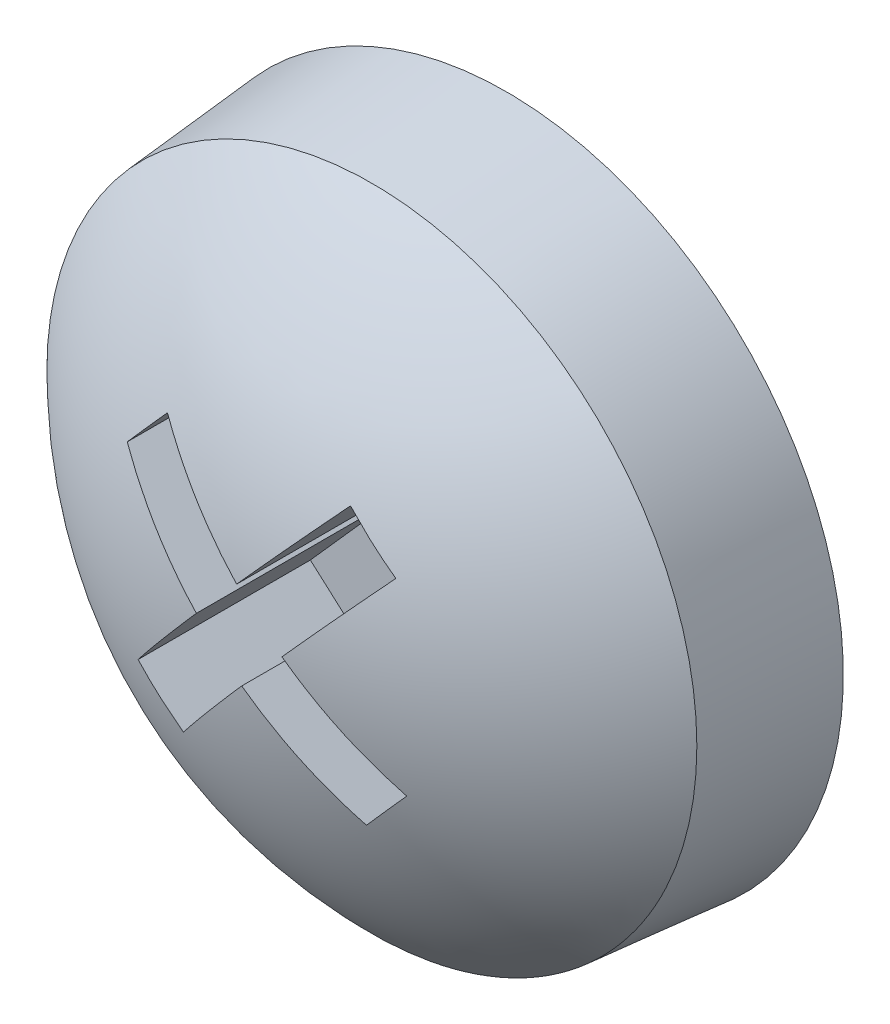
ISO-10303-21;
HEADER;
FILE_DESCRIPTION(('STEP AP214'),'2;1');
FILE_NAME('part.step','',(''),(''),'','','');
FILE_SCHEMA(('AUTOMOTIVE_DESIGN { 1 0 10303 214 1 1 1 1 }'));
ENDSEC;
DATA;
#1=APPLICATION_CONTEXT('core data for automotive mechanical design processes');
#2=APPLICATION_PROTOCOL_DEFINITION('international standard','automotive_design',2000,#1);
#3=PRODUCT_CONTEXT('',#1,'mechanical');
#4=PRODUCT('Part','Part','',(#3));
#5=PRODUCT_RELATED_PRODUCT_CATEGORY('part','',(#4));
#6=PRODUCT_DEFINITION_FORMATION('','',#4);
#7=PRODUCT_DEFINITION_CONTEXT('part definition',#1,'design');
#8=PRODUCT_DEFINITION('design','',#6,#7);
#9=PRODUCT_DEFINITION_SHAPE('','',#8);
#10=(LENGTH_UNIT() NAMED_UNIT(*) SI_UNIT(.MILLI.,.METRE.));
#11=(NAMED_UNIT(*) PLANE_ANGLE_UNIT() SI_UNIT($,.RADIAN.));
#12=(NAMED_UNIT(*) SI_UNIT($,.STERADIAN.) SOLID_ANGLE_UNIT());
#13=UNCERTAINTY_MEASURE_WITH_UNIT(LENGTH_MEASURE(1.E-05),#10,'distance_accuracy_value','');
#14=(GEOMETRIC_REPRESENTATION_CONTEXT(3) GLOBAL_UNCERTAINTY_ASSIGNED_CONTEXT((#13)) GLOBAL_UNIT_ASSIGNED_CONTEXT((#10,
#11,#12)) REPRESENTATION_CONTEXT('',''));
#15=CARTESIAN_POINT('',(0.,0.,0.));
#16=DIRECTION('',(0.,0.,1.));
#17=DIRECTION('',(1.,0.,0.));
#18=AXIS2_PLACEMENT_3D('',#15,#16,#17);
#19=CARTESIAN_POINT('',(6.89997712496555,4.50501230247056,21.6));
#20=DIRECTION('',(0.,0.,1.));
#21=DIRECTION('',(0.,-1.,0.));
#22=AXIS2_PLACEMENT_3D('',#19,#20,#21);
#23=PLANE('',#22);
#24=DIRECTION('',(0.747876143588401,-0.66383828893138,0.));
#25=VECTOR('',#24,1.);
#26=CARTESIAN_POINT('',(7.0194680169732,4.63963000831647,21.6));
#27=LINE('',#26,#25);
#28=CARTESIAN_POINT('',(7.15408572281911,4.52013911630882,21.6));
#29=VERTEX_POINT('',#28);
#30=CARTESIAN_POINT('',(7.72995035338218,4.00898363383166,21.6));
#31=VERTEX_POINT('',#30);
#32=EDGE_CURVE('E84',#29,#31,#27,.T.);
#33=ORIENTED_EDGE('',*,*,#32,.F.);
#34=DIRECTION('',(-0.66383828893138,-0.747876143588401,0.));
#35=VECTOR('',#34,1.);
#36=CARTESIAN_POINT('',(7.03459483081146,4.38552141046291,21.6));
#37=LINE('',#36,#35);
#38=CARTESIAN_POINT('',(7.66524120529627,5.09600374687189,21.6));
#39=VERTEX_POINT('',#38);
#40=EDGE_CURVE('E89',#39,#29,#37,.T.);
#41=ORIENTED_EDGE('',*,*,#40,.F.);
#42=DIRECTION('',(0.747876143588401,-0.66383828893138,0.));
#43=VECTOR('',#42,1.);
#44=CARTESIAN_POINT('',(7.53062349945036,5.21549463887954,21.6));
#45=LINE('',#44,#43);
#46=CARTESIAN_POINT('',(7.39600579360445,5.33498553088719,21.6));
#47=VERTEX_POINT('',#46);
#48=EDGE_CURVE('E140',#47,#39,#45,.T.);
#49=ORIENTED_EDGE('',*,*,#48,.F.);
#50=DIRECTION('',(0.66383828893138,0.747876143588401,0.));
#51=VECTOR('',#50,1.);
#52=CARTESIAN_POINT('',(6.76535941911964,4.62450319447821,21.6));
#53=LINE('',#52,#51);
#54=CARTESIAN_POINT('',(6.88485031112729,4.75912090032412,21.6));
#55=VERTEX_POINT('',#54);
#56=EDGE_CURVE('E151',#55,#47,#53,.T.);
#57=ORIENTED_EDGE('',*,*,#56,.F.);
#58=DIRECTION('',(0.747876143588401,-0.66383828893138,0.));
#59=VECTOR('',#58,1.);
#60=CARTESIAN_POINT('',(7.0194680169732,4.63963000831647,21.6));
#61=LINE('',#60,#59);
#62=CARTESIAN_POINT('',(6.30898568056422,5.27027638280128,21.6));
#63=VERTEX_POINT('',#62);
#64=EDGE_CURVE('E154',#63,#55,#61,.T.);
#65=ORIENTED_EDGE('',*,*,#64,.F.);
#66=DIRECTION('',(0.66383828893138,0.747876143588401,0.));
#67=VECTOR('',#66,1.);
#68=CARTESIAN_POINT('',(6.18949478855657,5.13565867695537,21.6));
#69=LINE('',#68,#67);
#70=CARTESIAN_POINT('',(6.07000389654892,5.00104097110946,21.6));
#71=VERTEX_POINT('',#70);
#72=EDGE_CURVE('E162',#71,#63,#69,.T.);
#73=ORIENTED_EDGE('',*,*,#72,.F.);
#74=DIRECTION('',(-0.747876143588401,0.66383828893138,0.));
#75=VECTOR('',#74,1.);
#76=CARTESIAN_POINT('',(6.7804862329579,4.37039459662465,21.6));
#77=LINE('',#76,#75);
#78=CARTESIAN_POINT('',(6.64586852711199,4.4898854886323,21.6));
#79=VERTEX_POINT('',#78);
#80=EDGE_CURVE('E167',#79,#71,#77,.T.);
#81=ORIENTED_EDGE('',*,*,#80,.F.);
#82=DIRECTION('',(0.66383828893138,0.747876143588401,0.));
#83=VECTOR('',#82,1.);
#84=CARTESIAN_POINT('',(6.76535941911964,4.62450319447821,21.6));
#85=LINE('',#84,#83);
#86=CARTESIAN_POINT('',(6.13471304463483,3.91402085806923,21.6));
#87=VERTEX_POINT('',#86);
#88=EDGE_CURVE('E172',#87,#79,#85,.T.);
#89=ORIENTED_EDGE('',*,*,#88,.F.);
#90=DIRECTION('',(0.747876143588401,-0.66383828893138,0.));
#91=VECTOR('',#90,1.);
#92=CARTESIAN_POINT('',(6.26933075048074,3.79452996606158,21.6));
#93=LINE('',#92,#91);
#94=CARTESIAN_POINT('',(6.40394845632666,3.67503907405393,21.6));
#95=VERTEX_POINT('',#94);
#96=EDGE_CURVE('E178',#87,#95,#93,.T.);
#97=ORIENTED_EDGE('',*,*,#96,.T.);
#98=DIRECTION('',(-0.66383828893138,-0.747876143588401,0.));
#99=VECTOR('',#98,1.);
#100=CARTESIAN_POINT('',(7.03459483081146,4.38552141046291,21.6));
#101=LINE('',#100,#99);
#102=CARTESIAN_POINT('',(6.91510393880381,4.250903704617,21.6));
#103=VERTEX_POINT('',#102);
#104=EDGE_CURVE('E183',#103,#95,#101,.T.);
#105=ORIENTED_EDGE('',*,*,#104,.F.);
#106=DIRECTION('',(-0.747876143588401,0.66383828893138,0.));
#107=VECTOR('',#106,1.);
#108=CARTESIAN_POINT('',(6.7804862329579,4.37039459662465,21.6));
#109=LINE('',#108,#107);
#110=CARTESIAN_POINT('',(7.49096856936688,3.73974822213984,21.6));
#111=VERTEX_POINT('',#110);
#112=EDGE_CURVE('E119',#111,#103,#109,.T.);
#113=ORIENTED_EDGE('',*,*,#112,.F.);
#114=DIRECTION('',(0.66383828893138,0.747876143588401,0.));
#115=VECTOR('',#114,1.);
#116=CARTESIAN_POINT('',(7.61045946137453,3.87436592798575,21.6));
#117=LINE('',#116,#115);
#118=EDGE_CURVE('E117',#111,#31,#117,.T.);
#119=ORIENTED_EDGE('',*,*,#118,.T.);
#120=EDGE_LOOP('',(#33,#41,#49,#57,#65,#73,#81,#89,#97,#105,#113,#119));
#121=FACE_BOUND('',#120,.T.);
#122=ADVANCED_FACE('F17',(#121),#23,.T.);
#123=CARTESIAN_POINT('',(7.0194680169732,4.63963000831647,22.2));
#124=DIRECTION('',(-0.66383828893138,-0.747876143588401,0.));
#125=DIRECTION('',(0.747876143588401,-0.66383828893138,0.));
#126=AXIS2_PLACEMENT_3D('',#123,#124,#125);
#127=PLANE('',#126);
#128=DIRECTION('',(0.,0.,1.));
#129=VECTOR('',#128,1.);
#130=CARTESIAN_POINT('',(7.15408572281911,4.52013911630882,22.2));
#131=LINE('',#130,#129);
#132=CARTESIAN_POINT('',(7.15408572281911,4.52013911630882,22.788097569794));
#133=VERTEX_POINT('',#132);
#134=EDGE_CURVE('E127',#29,#133,#131,.T.);
#135=ORIENTED_EDGE('',*,*,#134,.F.);
#136=ORIENTED_EDGE('',*,*,#32,.T.);
#137=DIRECTION('',(0.,0.,1.));
#138=VECTOR('',#137,1.);
#139=CARTESIAN_POINT('',(7.72995035338218,4.00898363383166,22.2));
#140=LINE('',#139,#138);
#141=CARTESIAN_POINT('',(7.72995035338218,4.00898363383166,22.6229045231911));
#142=VERTEX_POINT('',#141);
#143=EDGE_CURVE('E123',#31,#142,#140,.T.);
#144=ORIENTED_EDGE('',*,*,#143,.T.);
#145=CARTESIAN_POINT('',(7.15408572281911,4.52013911630882,22.788097569794));
#146=CARTESIAN_POINT('',(7.17877165659901,4.49822710830909,22.7859104299673));
#147=CARTESIAN_POINT('',(7.20342772135599,4.4763416129896,22.7831210421487));
#148=CARTESIAN_POINT('',(7.25255070327682,4.43273851567851,22.7763560552392));
#149=CARTESIAN_POINT('',(7.27701798297534,4.41102059188976,22.7723851623111));
#150=CARTESIAN_POINT('',(7.32576464164366,4.36775153088425,22.7632701136372));
#151=CARTESIAN_POINT('',(7.35004434494988,4.3462001057763,22.7581290588921));
#152=CARTESIAN_POINT('',(7.39841672115628,4.30326326960671,22.7466823115268));
#153=CARTESIAN_POINT('',(7.42250959829504,4.2818776772565,22.7403781619621));
#154=CARTESIAN_POINT('',(7.47050909335735,4.23927182206924,22.7266089835755));
#155=CARTESIAN_POINT('',(7.49441571128089,4.2180515592322,22.7191439547536));
#156=CARTESIAN_POINT('',(7.5420428123996,4.17577625257286,22.703052205587));
#157=CARTESIAN_POINT('',(7.56576300849104,4.15472146359282,22.6944239659575));
#158=CARTESIAN_POINT('',(7.61301615058749,4.11277809467423,22.6760004253173));
#159=CARTESIAN_POINT('',(7.63654844108106,4.09189009658817,22.666202118307));
#160=CARTESIAN_POINT('',(7.68342385204351,4.05028201365486,22.6454289197685));
#161=CARTESIAN_POINT('',(7.70676585941599,4.02956291682684,22.6344495373844));
#162=CARTESIAN_POINT('',(7.72995035338216,4.00898363383167,22.622904523191));
#163=B_SPLINE_CURVE_WITH_KNOTS('',3,(#145,#146,#147,#148,#149,#150,#151,#152,#153,#154,#155,
#156,#157,#158,#159,#160,#161,#162),.UNSPECIFIED.,.F.,.F.,(4,2,2,2,2,2,2,2,4),(0.,
0.0992357442434155,0.198081387639264,0.29666807248049,0.395124892694088,0.493581712907686,
0.59216839774891,0.691014041144759,0.790249785388175),.UNSPECIFIED.);
#164=EDGE_CURVE('E20',#133,#142,#163,.T.);
#165=ORIENTED_EDGE('',*,*,#164,.F.);
#166=EDGE_LOOP('',(#135,#136,#144,#165));
#167=FACE_BOUND('',#166,.T.);
#168=ADVANCED_FACE('F125',(#167),#127,.T.);
#169=CARTESIAN_POINT('',(7.61045946137453,3.87436592798575,22.2));
#170=DIRECTION('',(0.747876143588401,-0.66383828893138,0.));
#171=DIRECTION('',(0.66383828893138,0.747876143588401,0.));
#172=AXIS2_PLACEMENT_3D('',#169,#170,#171);
#173=PLANE('',#172);
#174=ORIENTED_EDGE('',*,*,#118,.F.);
#175=DIRECTION('',(0.,0.,1.));
#176=VECTOR('',#175,1.);
#177=CARTESIAN_POINT('',(7.49096856936688,3.73974822213984,22.2));
#178=LINE('',#177,#176);
#179=CARTESIAN_POINT('',(7.49096856936687,3.73974822213984,22.6229045231911));
#180=VERTEX_POINT('',#179);
#181=EDGE_CURVE('E132',#180,#111,#178,.F.);
#182=ORIENTED_EDGE('',*,*,#181,.F.);
#183=CARTESIAN_POINT('',(7.72995035338217,4.00898363383166,22.622904523191));
#184=CARTESIAN_POINT('',(7.69012005604629,3.96411106521635,22.6271329188894));
#185=CARTESIAN_POINT('',(7.65028975871041,3.91923849660105,22.6292471167385));
#186=CARTESIAN_POINT('',(7.57062916403865,3.82949335937045,22.6292471167385));
#187=CARTESIAN_POINT('',(7.53079886670277,3.78462079075514,22.6271329188894));
#188=CARTESIAN_POINT('',(7.49096856936688,3.73974822213984,22.622904523191));
#189=B_SPLINE_CURVE_WITH_KNOTS('',3,(#183,#184,#185,#186,#187,#188),.UNSPECIFIED.,.F.,.F.,(4,2,
4),(0.,0.180111711148684,0.360223422297368),.UNSPECIFIED.);
#190=EDGE_CURVE('E131',#142,#180,#189,.T.);
#191=ORIENTED_EDGE('',*,*,#190,.F.);
#192=ORIENTED_EDGE('',*,*,#143,.F.);
#193=EDGE_LOOP('',(#174,#182,#191,#192));
#194=FACE_BOUND('',#193,.T.);
#195=ADVANCED_FACE('F129',(#194),#173,.F.);
#196=CARTESIAN_POINT('',(6.7804862329579,4.37039459662465,22.2));
#197=DIRECTION('',(0.66383828893138,0.747876143588401,0.));
#198=DIRECTION('',(-0.747876143588401,0.66383828893138,0.));
#199=AXIS2_PLACEMENT_3D('',#196,#197,#198);
#200=PLANE('',#199);
#201=DIRECTION('',(0.,0.,1.));
#202=VECTOR('',#201,1.);
#203=CARTESIAN_POINT('',(6.91510393880381,4.250903704617,22.2));
#204=LINE('',#203,#202);
#205=CARTESIAN_POINT('',(6.91510393880381,4.250903704617,22.788097569794));
#206=VERTEX_POINT('',#205);
#207=EDGE_CURVE('E180',#206,#103,#204,.F.);
#208=ORIENTED_EDGE('',*,*,#207,.F.);
#209=CARTESIAN_POINT('',(7.49096856936687,3.73974822213985,22.622904523191));
#210=CARTESIAN_POINT('',(7.46778407540069,3.76032750513502,22.6344495373844));
#211=CARTESIAN_POINT('',(7.44444206802821,3.78104660196304,22.6454289197685));
#212=CARTESIAN_POINT('',(7.39756665706576,3.82265468489635,22.666202118307));
#213=CARTESIAN_POINT('',(7.37403436657219,3.84354268298241,22.6760004253173));
#214=CARTESIAN_POINT('',(7.32678122447574,3.885486051901,22.6944239659575));
#215=CARTESIAN_POINT('',(7.3030610283843,3.90654084088104,22.703052205587));
#216=CARTESIAN_POINT('',(7.25543392726559,3.94881614754038,22.7191439547536));
#217=CARTESIAN_POINT('',(7.23152730934205,3.97003641037742,22.7266089835755));
#218=CARTESIAN_POINT('',(7.18352781427975,4.01264226556468,22.7403781619621));
#219=CARTESIAN_POINT('',(7.15943493714099,4.03402785791489,22.7466823115268));
#220=CARTESIAN_POINT('',(7.11106256093458,4.07696469408448,22.7581290588921));
#221=CARTESIAN_POINT('',(7.08678285762836,4.09851611919243,22.7632701136372));
#222=CARTESIAN_POINT('',(7.03803619896004,4.14178518019794,22.7723851623111));
#223=CARTESIAN_POINT('',(7.01356891926152,4.16350310398669,22.7763560552392));
#224=CARTESIAN_POINT('',(6.96444593734069,4.20710620129778,22.7831210421487));
#225=CARTESIAN_POINT('',(6.93978987258371,4.22899169661727,22.7859104299673));
#226=CARTESIAN_POINT('',(6.91510393880381,4.250903704617,22.788097569794));
#227=B_SPLINE_CURVE_WITH_KNOTS('',3,(#209,#210,#211,#212,#213,#214,#215,#216,#217,#218,#219,
#220,#221,#222,#223,#224,#225,#226),.UNSPECIFIED.,.F.,.F.,(4,2,2,2,2,2,2,2,4),(0.,
0.0992357442434152,0.198081387639264,0.296668072480487,0.395124892694087,0.493581712907683,
0.592168397748909,0.691014041144759,0.790249785388172),.UNSPECIFIED.);
#228=EDGE_CURVE('E296',#180,#206,#227,.T.);
#229=ORIENTED_EDGE('',*,*,#228,.F.);
#230=ORIENTED_EDGE('',*,*,#181,.T.);
#231=ORIENTED_EDGE('',*,*,#112,.T.);
#232=EDGE_LOOP('',(#208,#229,#230,#231));
#233=FACE_BOUND('',#232,.T.);
#234=ADVANCED_FACE('F305',(#233),#200,.T.);
#235=CARTESIAN_POINT('',(7.03459483081146,4.38552141046291,22.2));
#236=DIRECTION('',(-0.747876143588401,0.66383828893138,0.));
#237=DIRECTION('',(-0.66383828893138,-0.747876143588401,0.));
#238=AXIS2_PLACEMENT_3D('',#235,#236,#237);
#239=PLANE('',#238);
#240=CARTESIAN_POINT('',(6.91510393880381,4.250903704617,22.788097569794));
#241=CARTESIAN_POINT('',(6.89319193080408,4.2262177708371,22.7859104299673));
#242=CARTESIAN_POINT('',(6.8713064354846,4.20156170608012,22.7831210421487));
#243=CARTESIAN_POINT('',(6.8277033381735,4.15243872415929,22.7763560552392));
#244=CARTESIAN_POINT('',(6.80598541438476,4.12797144446077,22.7723851623111));
#245=CARTESIAN_POINT('',(6.76271635337924,4.07922478579245,22.7632701136372));
#246=CARTESIAN_POINT('',(6.7411649282713,4.05494508248623,22.7581290588921));
#247=CARTESIAN_POINT('',(6.6982280921017,4.00657270627982,22.7466823115268));
#248=CARTESIAN_POINT('',(6.67684249975149,3.98247982914106,22.740378161962));
#249=CARTESIAN_POINT('',(6.63423664456424,3.93448033407876,22.7266089835755));
#250=CARTESIAN_POINT('',(6.61301638172719,3.91057371615522,22.7191439547536));
#251=CARTESIAN_POINT('',(6.57074107506785,3.86294661503651,22.703052205587));
#252=CARTESIAN_POINT('',(6.54968628608781,3.83922641894507,22.6944239659575));
#253=CARTESIAN_POINT('',(6.50774291716923,3.79197327684862,22.6760004253173));
#254=CARTESIAN_POINT('',(6.48685491908316,3.76844098635505,22.666202118307));
#255=CARTESIAN_POINT('',(6.44524683614985,3.7215655753926,22.6454289197685));
#256=CARTESIAN_POINT('',(6.42452773932184,3.69822356802012,22.6344495373844));
#257=CARTESIAN_POINT('',(6.40394845632666,3.67503907405395,22.622904523191));
#258=B_SPLINE_CURVE_WITH_KNOTS('',3,(#240,#241,#242,#243,#244,#245,#246,#247,#248,#249,#250,
#251,#252,#253,#254,#255,#256,#257),.UNSPECIFIED.,.F.,.F.,(4,2,2,2,2,2,2,2,4),(0.,
0.0992357442434142,0.198081387639265,0.29666807248049,0.395124892694088,0.493581712907687,
0.592168397748911,0.69101404114476,0.790249785388175),.UNSPECIFIED.);
#259=CARTESIAN_POINT('',(6.40394845632665,3.67503907405393,22.6229045231911));
#260=VERTEX_POINT('',#259);
#261=EDGE_CURVE('E289',#206,#260,#258,.T.);
#262=ORIENTED_EDGE('',*,*,#261,.F.);
#263=ORIENTED_EDGE('',*,*,#207,.T.);
#264=ORIENTED_EDGE('',*,*,#104,.T.);
#265=DIRECTION('',(0.,0.,1.));
#266=VECTOR('',#265,1.);
#267=CARTESIAN_POINT('',(6.40394845632666,3.67503907405393,22.2));
#268=LINE('',#267,#266);
#269=EDGE_CURVE('E175',#95,#260,#268,.T.);
#270=ORIENTED_EDGE('',*,*,#269,.T.);
#271=EDGE_LOOP('',(#262,#263,#264,#270));
#272=FACE_BOUND('',#271,.T.);
#273=ADVANCED_FACE('F302',(#272),#239,.T.);
#274=CARTESIAN_POINT('',(6.26933075048074,3.79452996606158,22.2));
#275=DIRECTION('',(-0.66383828893138,-0.747876143588401,0.));
#276=DIRECTION('',(0.747876143588401,-0.66383828893138,0.));
#277=AXIS2_PLACEMENT_3D('',#274,#275,#276);
#278=PLANE('',#277);
#279=ORIENTED_EDGE('',*,*,#96,.F.);
#280=DIRECTION('',(0.,0.,1.));
#281=VECTOR('',#280,1.);
#282=CARTESIAN_POINT('',(6.13471304463483,3.91402085806923,22.2));
#283=LINE('',#282,#281);
#284=CARTESIAN_POINT('',(6.13471304463484,3.91402085806924,22.6229045231911));
#285=VERTEX_POINT('',#284);
#286=EDGE_CURVE('E174',#285,#87,#283,.F.);
#287=ORIENTED_EDGE('',*,*,#286,.F.);
#288=CARTESIAN_POINT('',(6.40394845632665,3.67503907405393,22.622904523191));
#289=CARTESIAN_POINT('',(6.35907588771135,3.71486937138981,22.6271329188894));
#290=CARTESIAN_POINT('',(6.31420331909604,3.7546996687257,22.6292471167385));
#291=CARTESIAN_POINT('',(6.22445818186544,3.83436026339746,22.6292471167385));
#292=CARTESIAN_POINT('',(6.17958561325014,3.87419056073334,22.6271329188894));
#293=CARTESIAN_POINT('',(6.13471304463483,3.91402085806923,22.622904523191));
#294=B_SPLINE_CURVE_WITH_KNOTS('',3,(#288,#289,#290,#291,#292,#293),.UNSPECIFIED.,.F.,.F.,(4,2,
4),(0.,0.180111711148685,0.36022342229737),.UNSPECIFIED.);
#295=EDGE_CURVE('E282',#260,#285,#294,.T.);
#296=ORIENTED_EDGE('',*,*,#295,.F.);
#297=ORIENTED_EDGE('',*,*,#269,.F.);
#298=EDGE_LOOP('',(#279,#287,#296,#297));
#299=FACE_BOUND('',#298,.T.);
#300=ADVANCED_FACE('F271',(#299),#278,.F.);
#301=CARTESIAN_POINT('',(6.76535941911964,4.62450319447821,22.2));
#302=DIRECTION('',(0.747876143588401,-0.66383828893138,0.));
#303=DIRECTION('',(0.66383828893138,0.747876143588401,0.));
#304=AXIS2_PLACEMENT_3D('',#301,#302,#303);
#305=PLANE('',#304);
#306=CARTESIAN_POINT('',(6.13471304463484,3.91402085806925,22.622904523191));
#307=CARTESIAN_POINT('',(6.15529232763002,3.93720535203542,22.6344495373844));
#308=CARTESIAN_POINT('',(6.17601142445803,3.9605473594079,22.6454289197685));
#309=CARTESIAN_POINT('',(6.21761950739134,4.00742277037035,22.666202118307));
#310=CARTESIAN_POINT('',(6.23850750547741,4.03095506086392,22.6760004253173));
#311=CARTESIAN_POINT('',(6.28045087439599,4.07820820296037,22.6944239659575));
#312=CARTESIAN_POINT('',(6.30150566337603,4.10192839905181,22.703052205587));
#313=CARTESIAN_POINT('',(6.34378097003537,4.14955550017052,22.7191439547536));
#314=CARTESIAN_POINT('',(6.36500123287242,4.17346211809406,22.7266089835755));
#315=CARTESIAN_POINT('',(6.40760708805967,4.22146161315637,22.740378161962));
#316=CARTESIAN_POINT('',(6.42899268040988,4.24555449029512,22.7466823115268));
#317=CARTESIAN_POINT('',(6.47192951657947,4.29392686650153,22.7581290588921));
#318=CARTESIAN_POINT('',(6.49348094168742,4.31820656980775,22.7632701136372));
#319=CARTESIAN_POINT('',(6.53675000269294,4.36695322847607,22.7723851623111));
#320=CARTESIAN_POINT('',(6.55846792648168,4.39142050817459,22.7763560552392));
#321=CARTESIAN_POINT('',(6.60207102379277,4.44054349009542,22.7831210421487));
#322=CARTESIAN_POINT('',(6.62395651911226,4.4651995548524,22.7859104299673));
#323=CARTESIAN_POINT('',(6.64586852711199,4.4898854886323,22.788097569794));
#324=B_SPLINE_CURVE_WITH_KNOTS('',3,(#306,#307,#308,#309,#310,#311,#312,#313,#314,#315,#316,
#317,#318,#319,#320,#321,#322,#323),.UNSPECIFIED.,.F.,.F.,(4,2,2,2,2,2,2,2,4),(0.,
0.0992357442434145,0.198081387639263,0.296668072480487,0.395124892694086,0.493581712907683,
0.592168397748909,0.691014041144758,0.790249785388173),.UNSPECIFIED.);
#325=CARTESIAN_POINT('',(6.64586852711199,4.4898854886323,22.788097569794));
#326=VERTEX_POINT('',#325);
#327=EDGE_CURVE('E275',#285,#326,#324,.T.);
#328=ORIENTED_EDGE('',*,*,#327,.F.);
#329=ORIENTED_EDGE('',*,*,#286,.T.);
#330=ORIENTED_EDGE('',*,*,#88,.T.);
#331=DIRECTION('',(0.,0.,1.));
#332=VECTOR('',#331,1.);
#333=CARTESIAN_POINT('',(6.64586852711199,4.4898854886323,22.2));
#334=LINE('',#333,#332);
#335=EDGE_CURVE('E169',#326,#79,#334,.F.);
#336=ORIENTED_EDGE('',*,*,#335,.F.);
#337=EDGE_LOOP('',(#328,#329,#330,#336));
#338=FACE_BOUND('',#337,.T.);
#339=ADVANCED_FACE('F266',(#338),#305,.T.);
#340=CARTESIAN_POINT('',(6.7804862329579,4.37039459662465,22.2));
#341=DIRECTION('',(0.66383828893138,0.747876143588401,0.));
#342=DIRECTION('',(-0.747876143588401,0.66383828893138,0.));
#343=AXIS2_PLACEMENT_3D('',#340,#341,#342);
#344=PLANE('',#343);
#345=ORIENTED_EDGE('',*,*,#335,.T.);
#346=ORIENTED_EDGE('',*,*,#80,.T.);
#347=DIRECTION('',(0.,0.,1.));
#348=VECTOR('',#347,1.);
#349=CARTESIAN_POINT('',(6.07000389654892,5.00104097110945,22.2));
#350=LINE('',#349,#348);
#351=CARTESIAN_POINT('',(6.07000389654892,5.00104097110945,22.6229045231911));
#352=VERTEX_POINT('',#351);
#353=EDGE_CURVE('E164',#352,#71,#350,.F.);
#354=ORIENTED_EDGE('',*,*,#353,.F.);
#355=CARTESIAN_POINT('',(6.64586852711199,4.48988548863229,22.788097569794));
#356=CARTESIAN_POINT('',(6.62118259333209,4.51179749663203,22.7859104299673));
#357=CARTESIAN_POINT('',(6.59652652857511,4.53368299195151,22.7831210421487));
#358=CARTESIAN_POINT('',(6.54740354665428,4.57728608926261,22.7763560552392));
#359=CARTESIAN_POINT('',(6.52293626695576,4.59900401305135,22.7723851623111));
#360=CARTESIAN_POINT('',(6.47418960828744,4.64227307405686,22.7632701136372));
#361=CARTESIAN_POINT('',(6.44990990498122,4.66382449916481,22.7581290588921));
#362=CARTESIAN_POINT('',(6.40153752877482,4.70676133533441,22.7466823115268));
#363=CARTESIAN_POINT('',(6.37744465163606,4.72814692768462,22.740378161962));
#364=CARTESIAN_POINT('',(6.32944515657375,4.77075278287187,22.7266089835755));
#365=CARTESIAN_POINT('',(6.30553853865021,4.79197304570892,22.7191439547536));
#366=CARTESIAN_POINT('',(6.25791143753151,4.83424835236825,22.703052205587));
#367=CARTESIAN_POINT('',(6.23419124144006,4.8553031413483,22.6944239659575));
#368=CARTESIAN_POINT('',(6.18693809934362,4.89724651026688,22.6760004253173));
#369=CARTESIAN_POINT('',(6.16340580885004,4.91813450835295,22.666202118307));
#370=CARTESIAN_POINT('',(6.11653039788759,4.95974259128625,22.6454289197685));
#371=CARTESIAN_POINT('',(6.09318839051511,4.98046168811427,22.6344495373844));
#372=CARTESIAN_POINT('',(6.07000389654894,5.00104097110944,22.622904523191));
#373=B_SPLINE_CURVE_WITH_KNOTS('',3,(#355,#356,#357,#358,#359,#360,#361,#362,#363,#364,#365,
#366,#367,#368,#369,#370,#371,#372),.UNSPECIFIED.,.F.,.F.,(4,2,2,2,2,2,2,2,4),(0.,
0.0992357442434156,0.198081387639263,0.296668072480486,0.395124892694083,0.49358171290768,
0.592168397748903,0.691014041144751,0.790249785388166),.UNSPECIFIED.);
#374=EDGE_CURVE('E251',#326,#352,#373,.T.);
#375=ORIENTED_EDGE('',*,*,#374,.F.);
#376=EDGE_LOOP('',(#345,#346,#354,#375));
#377=FACE_BOUND('',#376,.T.);
#378=ADVANCED_FACE('F261',(#377),#344,.T.);
#379=CARTESIAN_POINT('',(6.18949478855657,5.13565867695537,22.2));
#380=DIRECTION('',(0.747876143588401,-0.66383828893138,0.));
#381=DIRECTION('',(0.66383828893138,0.747876143588401,0.));
#382=AXIS2_PLACEMENT_3D('',#379,#380,#381);
#383=PLANE('',#382);
#384=ORIENTED_EDGE('',*,*,#353,.T.);
#385=ORIENTED_EDGE('',*,*,#72,.T.);
#386=DIRECTION('',(0.,0.,1.));
#387=VECTOR('',#386,1.);
#388=CARTESIAN_POINT('',(6.30898568056422,5.27027638280128,22.2));
#389=LINE('',#388,#387);
#390=CARTESIAN_POINT('',(6.30898568056423,5.27027638280127,22.6229045231911));
#391=VERTEX_POINT('',#390);
#392=EDGE_CURVE('E159',#391,#63,#389,.F.);
#393=ORIENTED_EDGE('',*,*,#392,.F.);
#394=CARTESIAN_POINT('',(6.07000389654892,5.00104097110946,22.622904523191));
#395=CARTESIAN_POINT('',(6.1098341938848,5.04591353972476,22.6271329188894));
#396=CARTESIAN_POINT('',(6.14966449122069,5.09078610834006,22.6292471167385));
#397=CARTESIAN_POINT('',(6.22932508589245,5.18053124557067,22.6292471167385));
#398=CARTESIAN_POINT('',(6.26915538322833,5.22540381418597,22.6271329188894));
#399=CARTESIAN_POINT('',(6.30898568056421,5.27027638280128,22.622904523191));
#400=B_SPLINE_CURVE_WITH_KNOTS('',3,(#394,#395,#396,#397,#398,#399),.UNSPECIFIED.,.F.,.F.,(4,2,
4),(0.,0.180111711148686,0.360223422297372),.UNSPECIFIED.);
#401=EDGE_CURVE('E244',#352,#391,#400,.T.);
#402=ORIENTED_EDGE('',*,*,#401,.F.);
#403=EDGE_LOOP('',(#384,#385,#393,#402));
#404=FACE_BOUND('',#403,.T.);
#405=ADVANCED_FACE('F258',(#404),#383,.T.);
#406=CARTESIAN_POINT('',(7.0194680169732,4.63963000831647,22.2));
#407=DIRECTION('',(-0.66383828893138,-0.747876143588401,0.));
#408=DIRECTION('',(0.747876143588401,-0.66383828893138,0.));
#409=AXIS2_PLACEMENT_3D('',#406,#407,#408);
#410=PLANE('',#409);
#411=DIRECTION('',(0.,0.,1.));
#412=VECTOR('',#411,1.);
#413=CARTESIAN_POINT('',(6.88485031112729,4.75912090032412,22.2));
#414=LINE('',#413,#412);
#415=CARTESIAN_POINT('',(6.88485031112729,4.75912090032412,22.788097569794));
#416=VERTEX_POINT('',#415);
#417=EDGE_CURVE('E143',#416,#55,#414,.F.);
#418=ORIENTED_EDGE('',*,*,#417,.F.);
#419=CARTESIAN_POINT('',(6.30898568056424,5.27027638280126,22.622904523191));
#420=CARTESIAN_POINT('',(6.33217017453041,5.24969709980609,22.6344495373844));
#421=CARTESIAN_POINT('',(6.35551218190289,5.22897800297808,22.6454289197685));
#422=CARTESIAN_POINT('',(6.40238759286534,5.18736992004477,22.666202118307));
#423=CARTESIAN_POINT('',(6.42591988335891,5.1664819219587,22.6760004253173));
#424=CARTESIAN_POINT('',(6.47317302545536,5.12453855304012,22.6944239659575));
#425=CARTESIAN_POINT('',(6.4968932215468,5.10348376406007,22.703052205587));
#426=CARTESIAN_POINT('',(6.54452032266551,5.06120845740074,22.7191439547536));
#427=CARTESIAN_POINT('',(6.56842694058905,5.03998819456369,22.7266089835755));
#428=CARTESIAN_POINT('',(6.61642643565135,4.99738233937644,22.7403781619621));
#429=CARTESIAN_POINT('',(6.64051931279011,4.97599674702623,22.7466823115268));
#430=CARTESIAN_POINT('',(6.68889168899652,4.93305991085663,22.7581290588921));
#431=CARTESIAN_POINT('',(6.71317139230274,4.91150848574869,22.7632701136372));
#432=CARTESIAN_POINT('',(6.76191805097106,4.86823942474317,22.7723851623111));
#433=CARTESIAN_POINT('',(6.78638533066957,4.84652150095443,22.7763560552392));
#434=CARTESIAN_POINT('',(6.83550831259041,4.80291840364333,22.7831210421487));
#435=CARTESIAN_POINT('',(6.86016437734739,4.78103290832385,22.7859104299673));
#436=CARTESIAN_POINT('',(6.88485031112729,4.75912090032412,22.788097569794));
#437=B_SPLINE_CURVE_WITH_KNOTS('',3,(#419,#420,#421,#422,#423,#424,#425,#426,#427,#428,#429,
#430,#431,#432,#433,#434,#435,#436),.UNSPECIFIED.,.F.,.F.,(4,2,2,2,2,2,2,2,4),(0.,
0.099235744243414,0.198081387639263,0.296668072480487,0.395124892694085,0.493581712907683,
0.592168397748907,0.691014041144756,0.790249785388171),.UNSPECIFIED.);
#438=EDGE_CURVE('E237',#391,#416,#437,.T.);
#439=ORIENTED_EDGE('',*,*,#438,.F.);
#440=ORIENTED_EDGE('',*,*,#392,.T.);
#441=ORIENTED_EDGE('',*,*,#64,.T.);
#442=EDGE_LOOP('',(#418,#439,#440,#441));
#443=FACE_BOUND('',#442,.T.);
#444=ADVANCED_FACE('F226',(#443),#410,.T.);
#445=CARTESIAN_POINT('',(6.76535941911964,4.62450319447821,22.2));
#446=DIRECTION('',(0.747876143588401,-0.66383828893138,0.));
#447=DIRECTION('',(0.66383828893138,0.747876143588401,0.));
#448=AXIS2_PLACEMENT_3D('',#445,#446,#447);
#449=PLANE('',#448);
#450=CARTESIAN_POINT('',(6.88485031112729,4.75912090032412,22.788097569794));
#451=CARTESIAN_POINT('',(6.90676231912702,4.78380683410402,22.7859104299673));
#452=CARTESIAN_POINT('',(6.9286478144465,4.808462898861,22.7831210421487));
#453=CARTESIAN_POINT('',(6.9722509117576,4.85758588078183,22.7763560552392));
#454=CARTESIAN_POINT('',(6.99396883554634,4.88205316048035,22.7723851623111));
#455=CARTESIAN_POINT('',(7.03723789655186,4.93079981914866,22.7632701136372));
#456=CARTESIAN_POINT('',(7.0587893216598,4.95507952245489,22.7581290588921));
#457=CARTESIAN_POINT('',(7.1017261578294,5.00345189866129,22.7466823115268));
#458=CARTESIAN_POINT('',(7.1231117501796,5.02754477580005,22.7403781619621));
#459=CARTESIAN_POINT('',(7.16571760536686,5.07554427086235,22.7266089835755));
#460=CARTESIAN_POINT('',(7.1869378682039,5.0994508887859,22.7191439547536));
#461=CARTESIAN_POINT('',(7.22921317486324,5.1470779899046,22.703052205587));
#462=CARTESIAN_POINT('',(7.25026796384328,5.17079818599605,22.6944239659575));
#463=CARTESIAN_POINT('',(7.29221133276187,5.21805132809249,22.6760004253173));
#464=CARTESIAN_POINT('',(7.31309933084793,5.24158361858606,22.666202118307));
#465=CARTESIAN_POINT('',(7.35470741378124,5.28845902954852,22.6454289197685));
#466=CARTESIAN_POINT('',(7.37542651060926,5.31180103692099,22.6344495373844));
#467=CARTESIAN_POINT('',(7.39600579360443,5.33498553088716,22.6229045231911));
#468=B_SPLINE_CURVE_WITH_KNOTS('',3,(#450,#451,#452,#453,#454,#455,#456,#457,#458,#459,#460,
#461,#462,#463,#464,#465,#466,#467),.UNSPECIFIED.,.F.,.F.,(4,2,2,2,2,2,2,2,4),(0.,
0.0992357442434124,0.198081387639261,0.296668072480483,0.39512489269408,0.493581712907676,
0.592168397748899,0.691014041144748,0.790249785388161),.UNSPECIFIED.);
#469=CARTESIAN_POINT('',(7.39600579360445,5.33498553088718,22.6229045231911));
#470=VERTEX_POINT('',#469);
#471=EDGE_CURVE('E230',#416,#470,#468,.T.);
#472=ORIENTED_EDGE('',*,*,#471,.F.);
#473=ORIENTED_EDGE('',*,*,#417,.T.);
#474=ORIENTED_EDGE('',*,*,#56,.T.);
#475=DIRECTION('',(0.,0.,1.));
#476=VECTOR('',#475,1.);
#477=CARTESIAN_POINT('',(7.39600579360445,5.33498553088718,22.2));
#478=LINE('',#477,#476);
#479=EDGE_CURVE('E142',#470,#47,#478,.F.);
#480=ORIENTED_EDGE('',*,*,#479,.F.);
#481=EDGE_LOOP('',(#472,#473,#474,#480));
#482=FACE_BOUND('',#481,.T.);
#483=ADVANCED_FACE('F222',(#482),#449,.T.);
#484=CARTESIAN_POINT('',(7.53062349945036,5.21549463887954,22.2));
#485=DIRECTION('',(-0.66383828893138,-0.747876143588401,0.));
#486=DIRECTION('',(0.747876143588401,-0.66383828893138,0.));
#487=AXIS2_PLACEMENT_3D('',#484,#485,#486);
#488=PLANE('',#487);
#489=CARTESIAN_POINT('',(7.39600579360445,5.33498553088718,22.622904523191));
#490=CARTESIAN_POINT('',(7.44087836221976,5.2951552335513,22.6271329188894));
#491=CARTESIAN_POINT('',(7.48575093083506,5.25532493621542,22.6292471167385));
#492=CARTESIAN_POINT('',(7.57549606806566,5.17566434154365,22.6292471167385));
#493=CARTESIAN_POINT('',(7.62036863668096,5.13583404420777,22.6271329188894));
#494=CARTESIAN_POINT('',(7.66524120529627,5.09600374687189,22.622904523191));
#495=B_SPLINE_CURVE_WITH_KNOTS('',3,(#489,#490,#491,#492,#493,#494),.UNSPECIFIED.,.F.,.F.,(4,2,
4),(0.,0.180111711148683,0.360223422297366),.UNSPECIFIED.);
#496=CARTESIAN_POINT('',(7.66524120529626,5.09600374687188,22.6229045231911));
#497=VERTEX_POINT('',#496);
#498=EDGE_CURVE('E203',#470,#497,#495,.T.);
#499=ORIENTED_EDGE('',*,*,#498,.F.);
#500=ORIENTED_EDGE('',*,*,#479,.T.);
#501=ORIENTED_EDGE('',*,*,#48,.T.);
#502=DIRECTION('',(0.,0.,1.));
#503=VECTOR('',#502,1.);
#504=CARTESIAN_POINT('',(7.66524120529627,5.09600374687189,22.2));
#505=LINE('',#504,#503);
#506=EDGE_CURVE('E40',#497,#39,#505,.F.);
#507=ORIENTED_EDGE('',*,*,#506,.F.);
#508=EDGE_LOOP('',(#499,#500,#501,#507));
#509=FACE_BOUND('',#508,.T.);
#510=ADVANCED_FACE('F217',(#509),#488,.T.);
#511=CARTESIAN_POINT('',(7.03459483081146,4.38552141046291,22.2));
#512=DIRECTION('',(-0.747876143588401,0.66383828893138,0.));
#513=DIRECTION('',(-0.66383828893138,-0.747876143588401,0.));
#514=AXIS2_PLACEMENT_3D('',#511,#512,#513);
#515=PLANE('',#514);
#516=CARTESIAN_POINT('',(7.66524120529626,5.09600374687188,22.622904523191));
#517=CARTESIAN_POINT('',(7.64466192230108,5.0728192529057,22.6344495373844));
#518=CARTESIAN_POINT('',(7.62394282547307,5.04947724553322,22.6454289197685));
#519=CARTESIAN_POINT('',(7.58233474253976,5.00260183457077,22.666202118307));
#520=CARTESIAN_POINT('',(7.5614467444537,4.9790695440772,22.6760004253173));
#521=CARTESIAN_POINT('',(7.51950337553511,4.93181640198075,22.6944239659575));
#522=CARTESIAN_POINT('',(7.49844858655507,4.90809620588931,22.703052205587));
#523=CARTESIAN_POINT('',(7.45617327989573,4.8604691047706,22.7191439547536));
#524=CARTESIAN_POINT('',(7.43495301705868,4.83656248684706,22.7266089835755));
#525=CARTESIAN_POINT('',(7.39234716187143,4.78856299178476,22.7403781619621));
#526=CARTESIAN_POINT('',(7.37096156952122,4.764470114646,22.7466823115268));
#527=CARTESIAN_POINT('',(7.32802473335162,4.71609773843959,22.7581290588921));
#528=CARTESIAN_POINT('',(7.30647330824368,4.69181803513337,22.7632701136372));
#529=CARTESIAN_POINT('',(7.26320424723816,4.64307137646505,22.7723851623111));
#530=CARTESIAN_POINT('',(7.24148632344942,4.61860409676653,22.7763560552392));
#531=CARTESIAN_POINT('',(7.19788322613832,4.5694811148457,22.7831210421487));
#532=CARTESIAN_POINT('',(7.17599773081884,4.54482505008871,22.7859104299673));
#533=CARTESIAN_POINT('',(7.15408572281911,4.52013911630882,22.788097569794));
#534=B_SPLINE_CURVE_WITH_KNOTS('',3,(#516,#517,#518,#519,#520,#521,#522,#523,#524,#525,#526,
#527,#528,#529,#530,#531,#532,#533),.UNSPECIFIED.,.F.,.F.,(4,2,2,2,2,2,2,2,4),(0.,
0.0992357442434159,0.198081387639265,0.29666807248049,0.395124892694088,0.493581712907684,
0.592168397748911,0.691014041144761,0.790249785388176),.UNSPECIFIED.);
#535=EDGE_CURVE('E195',#497,#133,#534,.T.);
#536=ORIENTED_EDGE('',*,*,#535,.F.);
#537=ORIENTED_EDGE('',*,*,#506,.T.);
#538=ORIENTED_EDGE('',*,*,#40,.T.);
#539=ORIENTED_EDGE('',*,*,#134,.T.);
#540=EDGE_LOOP('',(#536,#537,#538,#539));
#541=FACE_BOUND('',#540,.T.);
#542=ADVANCED_FACE('F214',(#541),#515,.T.);
#543=CARTESIAN_POINT('',(6.89997712496556,4.50501230247056,20.0719156205536));
#544=DIRECTION('',(0.460133509726887,-0.667997322687943,0.584856161896373));
#545=DIRECTION('',(0.,-0.658733272493448,-0.752376551807719));
#546=AXIS2_PLACEMENT_3D('',#543,#544,#545);
#547=SPHERICAL_SURFACE('',#546,2.72808437944638);
#548=ORIENTED_EDGE('',*,*,#498,.T.);
#549=ORIENTED_EDGE('',*,*,#535,.T.);
#550=ORIENTED_EDGE('',*,*,#164,.T.);
#551=ORIENTED_EDGE('',*,*,#190,.T.);
#552=ORIENTED_EDGE('',*,*,#228,.T.);
#553=ORIENTED_EDGE('',*,*,#261,.T.);
#554=ORIENTED_EDGE('',*,*,#295,.T.);
#555=ORIENTED_EDGE('',*,*,#327,.T.);
#556=ORIENTED_EDGE('',*,*,#374,.T.);
#557=ORIENTED_EDGE('',*,*,#401,.T.);
#558=ORIENTED_EDGE('',*,*,#438,.T.);
#559=ORIENTED_EDGE('',*,*,#471,.T.);
#560=EDGE_LOOP('',(#548,#549,#550,#551,#552,#553,#554,#555,#556,#557,#558,#559));
#561=FACE_BOUND('',#560,.T.);
#562=CARTESIAN_POINT('',(6.89997712496555,4.50501230247056,21.9999999999914));
#563=DIRECTION('',(0.,0.,-1.));
#564=DIRECTION('',(-1.,0.,0.));
#565=AXIS2_PLACEMENT_3D('',#562,#563,#564);
#566=CIRCLE('',#565,1.9300090691825);
#567=CARTESIAN_POINT('',(4.96996805578305,4.50501230247056,21.9999999999914));
#568=VERTEX_POINT('',#567);
#569=EDGE_CURVE('E31',#568,#568,#566,.T.);
#570=ORIENTED_EDGE('',*,*,#569,.F.);
#571=EDGE_LOOP('',(#570));
#572=FACE_BOUND('',#571,.T.);
#573=ADVANCED_FACE('F210',(#561,#572),#547,.T.);
#574=CARTESIAN_POINT('',(6.89997712496555,4.50501230247056,21.2000000000216));
#575=DIRECTION('',(0.,0.,-1.));
#576=DIRECTION('',(-1.,0.,0.));
#577=AXIS2_PLACEMENT_3D('',#574,#575,#576);
#578=CONICAL_SURFACE('',#577,2.00000000000248,0.0872664626020624);
#579=ORIENTED_EDGE('',*,*,#569,.T.);
#580=EDGE_LOOP('',(#579));
#581=FACE_BOUND('',#580,.T.);
#582=CARTESIAN_POINT('',(6.89997712496555,4.50501230247056,21.1999999999648));
#583=DIRECTION('',(0.,0.,-1.));
#584=DIRECTION('',(-1.,0.,0.));
#585=AXIS2_PLACEMENT_3D('',#582,#583,#584);
#586=CIRCLE('',#585,2.00000000000745);
#587=CARTESIAN_POINT('',(4.8999771249581,4.50501230247056,21.1999999999648));
#588=VERTEX_POINT('',#587);
#589=EDGE_CURVE('E11',#588,#588,#586,.T.);
#590=ORIENTED_EDGE('',*,*,#589,.F.);
#591=EDGE_LOOP('',(#590));
#592=FACE_BOUND('',#591,.T.);
#593=ADVANCED_FACE('F382',(#581,#592),#578,.T.);
#594=CARTESIAN_POINT('',(7.64785326855395,3.84117401353918,21.2));
#595=DIRECTION('',(0.,0.,-1.));
#596=DIRECTION('',(0.,1.,0.));
#597=AXIS2_PLACEMENT_3D('',#594,#595,#596);
#598=PLANE('',#597);
#599=ORIENTED_EDGE('',*,*,#589,.T.);
#600=EDGE_LOOP('',(#599));
#601=FACE_BOUND('',#600,.T.);
#602=ADVANCED_FACE('F380',(#601),#598,.T.);
#603=CLOSED_SHELL('',(#122,#168,#195,#234,#273,#300,#339,#378,#405,#444,#483,#510,#542,#573,
#593,#602));
#604=MANIFOLD_SOLID_BREP('B1',#603);
#605=ADVANCED_BREP_SHAPE_REPRESENTATION('',(#18,#604),#14);
#606=SHAPE_DEFINITION_REPRESENTATION(#9,#605);
ENDSEC;
END-ISO-10303-21;
